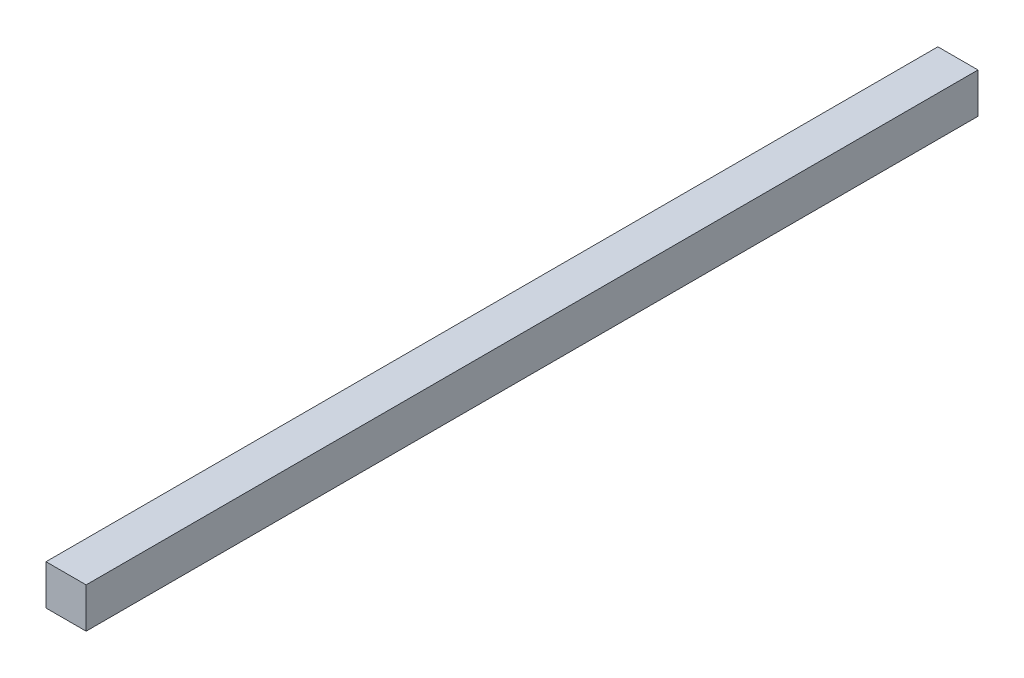
ISO-10303-21;
HEADER;
FILE_DESCRIPTION(('STEP AP214'),'2;1');
FILE_NAME('part.step','',(''),(''),'','','');
FILE_SCHEMA(('AUTOMOTIVE_DESIGN { 1 0 10303 214 1 1 1 1 }'));
ENDSEC;
DATA;
#1=APPLICATION_CONTEXT('core data for automotive mechanical design processes');
#2=APPLICATION_PROTOCOL_DEFINITION('international standard','automotive_design',2000,#1);
#3=PRODUCT_CONTEXT('',#1,'mechanical');
#4=PRODUCT('Part','Part','',(#3));
#5=PRODUCT_RELATED_PRODUCT_CATEGORY('part','',(#4));
#6=PRODUCT_DEFINITION_FORMATION('','',#4);
#7=PRODUCT_DEFINITION_CONTEXT('part definition',#1,'design');
#8=PRODUCT_DEFINITION('design','',#6,#7);
#9=PRODUCT_DEFINITION_SHAPE('','',#8);
#10=(LENGTH_UNIT() NAMED_UNIT(*) SI_UNIT(.MILLI.,.METRE.));
#11=(NAMED_UNIT(*) PLANE_ANGLE_UNIT() SI_UNIT($,.RADIAN.));
#12=(NAMED_UNIT(*) SI_UNIT($,.STERADIAN.) SOLID_ANGLE_UNIT());
#13=UNCERTAINTY_MEASURE_WITH_UNIT(LENGTH_MEASURE(1.E-05),#10,'distance_accuracy_value','');
#14=(GEOMETRIC_REPRESENTATION_CONTEXT(3) GLOBAL_UNCERTAINTY_ASSIGNED_CONTEXT((#13)) GLOBAL_UNIT_ASSIGNED_CONTEXT((#10,
#11,#12)) REPRESENTATION_CONTEXT('',''));
#15=CARTESIAN_POINT('',(0.,0.,0.));
#16=DIRECTION('',(0.,0.,1.));
#17=DIRECTION('',(1.,0.,0.));
#18=AXIS2_PLACEMENT_3D('',#15,#16,#17);
#19=CARTESIAN_POINT('',(0.,0.,1000.));
#20=DIRECTION('',(1.,0.,0.));
#21=DIRECTION('',(0.,0.,-1.));
#22=AXIS2_PLACEMENT_3D('',#19,#20,#21);
#23=PLANE('',#22);
#24=DIRECTION('',(0.,-1.,0.));
#25=VECTOR('',#24,1.);
#26=CARTESIAN_POINT('',(0.,0.,0.));
#27=LINE('',#26,#25);
#28=CARTESIAN_POINT('',(0.,45.,0.));
#29=VERTEX_POINT('',#28);
#30=CARTESIAN_POINT('',(0.,0.,0.));
#31=VERTEX_POINT('',#30);
#32=EDGE_CURVE('E107',#29,#31,#27,.T.);
#33=ORIENTED_EDGE('',*,*,#32,.T.);
#34=DIRECTION('',(0.,0.,-1.));
#35=VECTOR('',#34,1.);
#36=CARTESIAN_POINT('',(0.,0.,1000.));
#37=LINE('',#36,#35);
#38=CARTESIAN_POINT('',(0.,0.,1000.));
#39=VERTEX_POINT('',#38);
#40=EDGE_CURVE('E11',#39,#31,#37,.T.);
#41=ORIENTED_EDGE('',*,*,#40,.F.);
#42=DIRECTION('',(0.,-1.,0.));
#43=VECTOR('',#42,1.);
#44=CARTESIAN_POINT('',(0.,0.,1000.));
#45=LINE('',#44,#43);
#46=CARTESIAN_POINT('',(0.,45.,1000.));
#47=VERTEX_POINT('',#46);
#48=EDGE_CURVE('E91',#47,#39,#45,.T.);
#49=ORIENTED_EDGE('',*,*,#48,.F.);
#50=DIRECTION('',(0.,0.,-1.));
#51=VECTOR('',#50,1.);
#52=CARTESIAN_POINT('',(0.,45.,1000.));
#53=LINE('',#52,#51);
#54=EDGE_CURVE('E103',#47,#29,#53,.T.);
#55=ORIENTED_EDGE('',*,*,#54,.T.);
#56=EDGE_LOOP('',(#33,#41,#49,#55));
#57=FACE_BOUND('',#56,.T.);
#58=ADVANCED_FACE('F39',(#57),#23,.F.);
#59=CARTESIAN_POINT('',(0.,0.,1000.));
#60=DIRECTION('',(0.,1.,0.));
#61=DIRECTION('',(0.,0.,1.));
#62=AXIS2_PLACEMENT_3D('',#59,#60,#61);
#63=PLANE('',#62);
#64=DIRECTION('',(1.,0.,0.));
#65=VECTOR('',#64,1.);
#66=CARTESIAN_POINT('',(0.,0.,0.));
#67=LINE('',#66,#65);
#68=CARTESIAN_POINT('',(45.,0.,0.));
#69=VERTEX_POINT('',#68);
#70=EDGE_CURVE('E96',#31,#69,#67,.T.);
#71=ORIENTED_EDGE('',*,*,#70,.T.);
#72=DIRECTION('',(0.,0.,-1.));
#73=VECTOR('',#72,1.);
#74=CARTESIAN_POINT('',(45.,0.,1000.));
#75=LINE('',#74,#73);
#76=CARTESIAN_POINT('',(45.,0.,1000.));
#77=VERTEX_POINT('',#76);
#78=EDGE_CURVE('E48',#77,#69,#75,.T.);
#79=ORIENTED_EDGE('',*,*,#78,.F.);
#80=DIRECTION('',(1.,0.,0.));
#81=VECTOR('',#80,1.);
#82=CARTESIAN_POINT('',(0.,0.,1000.));
#83=LINE('',#82,#81);
#84=EDGE_CURVE('E86',#39,#77,#83,.T.);
#85=ORIENTED_EDGE('',*,*,#84,.F.);
#86=ORIENTED_EDGE('',*,*,#40,.T.);
#87=EDGE_LOOP('',(#71,#79,#85,#86));
#88=FACE_BOUND('',#87,.T.);
#89=ADVANCED_FACE('F95',(#88),#63,.F.);
#90=CARTESIAN_POINT('',(45.,0.,1000.));
#91=DIRECTION('',(-1.,0.,0.));
#92=DIRECTION('',(0.,0.,1.));
#93=AXIS2_PLACEMENT_3D('',#90,#91,#92);
#94=PLANE('',#93);
#95=DIRECTION('',(0.,1.,0.));
#96=VECTOR('',#95,1.);
#97=CARTESIAN_POINT('',(45.,0.,0.));
#98=LINE('',#97,#96);
#99=CARTESIAN_POINT('',(45.,45.,0.));
#100=VERTEX_POINT('',#99);
#101=EDGE_CURVE('E73',#69,#100,#98,.T.);
#102=ORIENTED_EDGE('',*,*,#101,.T.);
#103=DIRECTION('',(0.,0.,-1.));
#104=VECTOR('',#103,1.);
#105=CARTESIAN_POINT('',(45.,45.,1000.));
#106=LINE('',#105,#104);
#107=CARTESIAN_POINT('',(45.,45.,1000.));
#108=VERTEX_POINT('',#107);
#109=EDGE_CURVE('E98',#108,#100,#106,.T.);
#110=ORIENTED_EDGE('',*,*,#109,.F.);
#111=DIRECTION('',(0.,1.,0.));
#112=VECTOR('',#111,1.);
#113=CARTESIAN_POINT('',(45.,0.,1000.));
#114=LINE('',#113,#112);
#115=EDGE_CURVE('E89',#77,#108,#114,.T.);
#116=ORIENTED_EDGE('',*,*,#115,.F.);
#117=ORIENTED_EDGE('',*,*,#78,.T.);
#118=EDGE_LOOP('',(#102,#110,#116,#117));
#119=FACE_BOUND('',#118,.T.);
#120=ADVANCED_FACE('F99',(#119),#94,.F.);
#121=CARTESIAN_POINT('',(0.,45.,1000.));
#122=DIRECTION('',(0.,-1.,0.));
#123=DIRECTION('',(0.,0.,-1.));
#124=AXIS2_PLACEMENT_3D('',#121,#122,#123);
#125=PLANE('',#124);
#126=DIRECTION('',(-1.,0.,0.));
#127=VECTOR('',#126,1.);
#128=CARTESIAN_POINT('',(0.,45.,0.));
#129=LINE('',#128,#127);
#130=EDGE_CURVE('E79',#100,#29,#129,.T.);
#131=ORIENTED_EDGE('',*,*,#130,.T.);
#132=ORIENTED_EDGE('',*,*,#54,.F.);
#133=DIRECTION('',(-1.,0.,0.));
#134=VECTOR('',#133,1.);
#135=CARTESIAN_POINT('',(0.,45.,1000.));
#136=LINE('',#135,#134);
#137=EDGE_CURVE('E56',#108,#47,#136,.T.);
#138=ORIENTED_EDGE('',*,*,#137,.F.);
#139=ORIENTED_EDGE('',*,*,#109,.T.);
#140=EDGE_LOOP('',(#131,#132,#138,#139));
#141=FACE_BOUND('',#140,.T.);
#142=ADVANCED_FACE('F120',(#141),#125,.F.);
#143=CARTESIAN_POINT('',(0.,0.,1000.));
#144=DIRECTION('',(0.,0.,-1.));
#145=DIRECTION('',(-1.,0.,0.));
#146=AXIS2_PLACEMENT_3D('',#143,#144,#145);
#147=PLANE('',#146);
#148=ORIENTED_EDGE('',*,*,#48,.T.);
#149=ORIENTED_EDGE('',*,*,#84,.T.);
#150=ORIENTED_EDGE('',*,*,#115,.T.);
#151=ORIENTED_EDGE('',*,*,#137,.T.);
#152=EDGE_LOOP('',(#148,#149,#150,#151));
#153=FACE_BOUND('',#152,.T.);
#154=ADVANCED_FACE('F87',(#153),#147,.F.);
#155=CARTESIAN_POINT('',(0.,0.,0.));
#156=DIRECTION('',(0.,0.,-1.));
#157=DIRECTION('',(-1.,0.,0.));
#158=AXIS2_PLACEMENT_3D('',#155,#156,#157);
#159=PLANE('',#158);
#160=ORIENTED_EDGE('',*,*,#32,.F.);
#161=ORIENTED_EDGE('',*,*,#130,.F.);
#162=ORIENTED_EDGE('',*,*,#101,.F.);
#163=ORIENTED_EDGE('',*,*,#70,.F.);
#164=EDGE_LOOP('',(#160,#161,#162,#163));
#165=FACE_BOUND('',#164,.T.);
#166=ADVANCED_FACE('F123',(#165),#159,.T.);
#167=CLOSED_SHELL('',(#58,#89,#120,#142,#154,#166));
#168=MANIFOLD_SOLID_BREP('B2',#167);
#169=ADVANCED_BREP_SHAPE_REPRESENTATION('',(#18,#168),#14);
#170=SHAPE_DEFINITION_REPRESENTATION(#9,#169);
ENDSEC;
END-ISO-10303-21;
